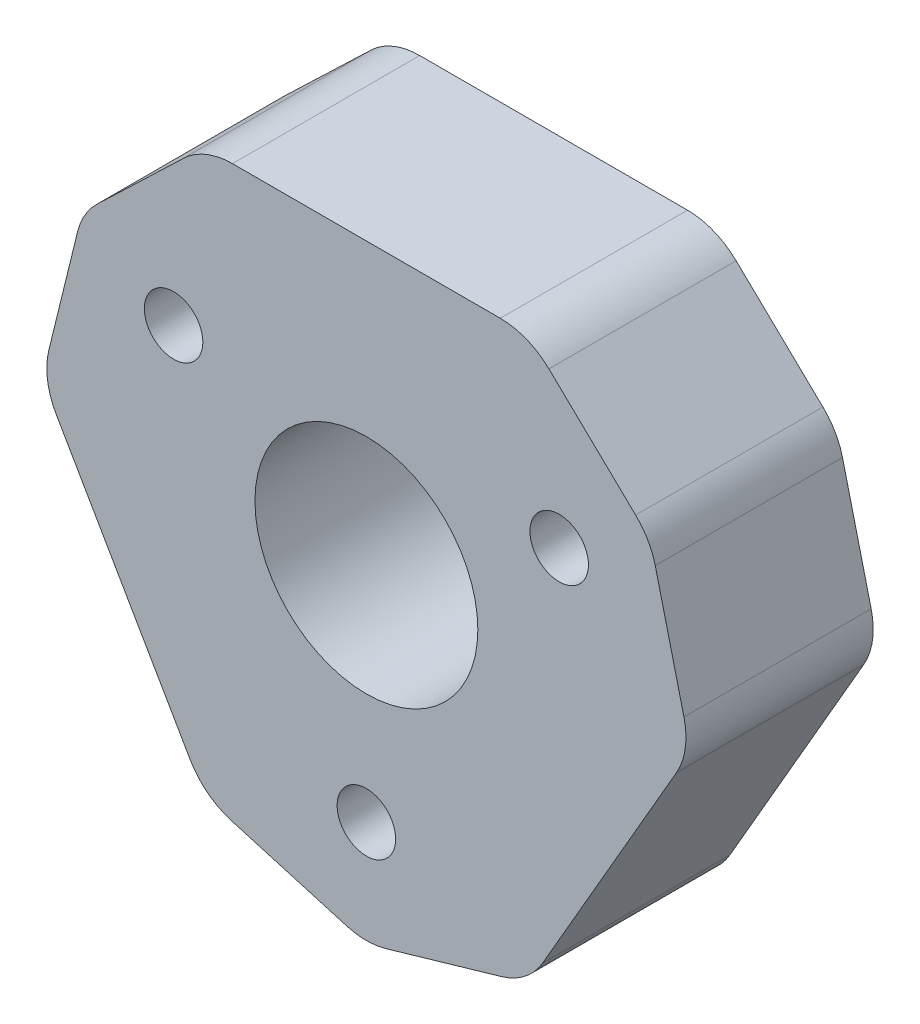
ISO-10303-21;
HEADER;
FILE_DESCRIPTION(('STEP AP214'),'2;1');
FILE_NAME('part.step','',(''),(''),'','','');
FILE_SCHEMA(('AUTOMOTIVE_DESIGN { 1 0 10303 214 1 1 1 1 }'));
ENDSEC;
DATA;
#1=APPLICATION_CONTEXT('core data for automotive mechanical design processes');
#2=APPLICATION_PROTOCOL_DEFINITION('international standard','automotive_design',2000,#1);
#3=PRODUCT_CONTEXT('',#1,'mechanical');
#4=PRODUCT('Part','Part','',(#3));
#5=PRODUCT_RELATED_PRODUCT_CATEGORY('part','',(#4));
#6=PRODUCT_DEFINITION_FORMATION('','',#4);
#7=PRODUCT_DEFINITION_CONTEXT('part definition',#1,'design');
#8=PRODUCT_DEFINITION('design','',#6,#7);
#9=PRODUCT_DEFINITION_SHAPE('','',#8);
#10=(LENGTH_UNIT() NAMED_UNIT(*) SI_UNIT(.MILLI.,.METRE.));
#11=(NAMED_UNIT(*) PLANE_ANGLE_UNIT() SI_UNIT($,.RADIAN.));
#12=(NAMED_UNIT(*) SI_UNIT($,.STERADIAN.) SOLID_ANGLE_UNIT());
#13=UNCERTAINTY_MEASURE_WITH_UNIT(LENGTH_MEASURE(1.E-05),#10,'distance_accuracy_value','');
#14=(GEOMETRIC_REPRESENTATION_CONTEXT(3) GLOBAL_UNCERTAINTY_ASSIGNED_CONTEXT((#13)) GLOBAL_UNIT_ASSIGNED_CONTEXT((#10,
#11,#12)) REPRESENTATION_CONTEXT('',''));
#15=CARTESIAN_POINT('',(0.,0.,0.));
#16=DIRECTION('',(0.,0.,1.));
#17=DIRECTION('',(1.,0.,0.));
#18=AXIS2_PLACEMENT_3D('',#15,#16,#17);
#19=CARTESIAN_POINT('',(0.,-10.888495471054,8.));
#20=DIRECTION('',(0.,0.,1.));
#21=DIRECTION('',(1.,0.,0.));
#22=AXIS2_PLACEMENT_3D('',#19,#20,#21);
#23=PLANE('',#22);
#24=CARTESIAN_POINT('',(8.23806665349945,4.75625000000004,8.));
#25=DIRECTION('',(0.,0.,1.));
#26=DIRECTION('',(1.,0.,0.));
#27=AXIS2_PLACEMENT_3D('',#24,#25,#26);
#28=CIRCLE('',#27,1.25);
#29=CARTESIAN_POINT('',(9.48806665349945,4.75625000000004,8.));
#30=VERTEX_POINT('',#29);
#31=EDGE_CURVE('E383',#30,#30,#28,.T.);
#32=ORIENTED_EDGE('',*,*,#31,.F.);
#33=EDGE_LOOP('',(#32));
#34=FACE_BOUND('',#33,.T.);
#35=CARTESIAN_POINT('',(0.,0.,8.));
#36=DIRECTION('',(0.,0.,1.));
#37=DIRECTION('',(1.,0.,0.));
#38=AXIS2_PLACEMENT_3D('',#35,#36,#37);
#39=CIRCLE('',#38,4.7625);
#40=CARTESIAN_POINT('',(4.7625,0.,8.));
#41=VERTEX_POINT('',#40);
#42=EDGE_CURVE('E208',#41,#41,#39,.T.);
#43=ORIENTED_EDGE('',*,*,#42,.F.);
#44=EDGE_LOOP('',(#43));
#45=FACE_BOUND('',#44,.T.);
#46=CARTESIAN_POINT('',(0.,-10.888495471054,8.));
#47=DIRECTION('',(0.,0.,1.));
#48=DIRECTION('',(1.,0.,0.));
#49=AXIS2_PLACEMENT_3D('',#46,#47,#48);
#50=CIRCLE('',#49,3.);
#51=CARTESIAN_POINT('',(-0.836847118322304,-13.7694131895173,8.));
#52=VERTEX_POINT('',#51);
#53=CARTESIAN_POINT('',(0.836847118322307,-13.7694131895173,8.));
#54=VERTEX_POINT('',#53);
#55=EDGE_CURVE('E239',#52,#54,#50,.T.);
#56=ORIENTED_EDGE('',*,*,#55,.T.);
#57=DIRECTION('',(0.960305906154426,0.278949039440768,0.));
#58=VECTOR('',#57,1.);
#59=CARTESIAN_POINT('',(0.836847118322307,-13.7694131895173,8.));
#60=LINE('',#59,#58);
#61=CARTESIAN_POINT('',(5.77000843492431,-12.3364316761752,8.));
#62=VERTEX_POINT('',#61);
#63=EDGE_CURVE('E137',#54,#62,#60,.T.);
#64=ORIENTED_EDGE('',*,*,#63,.T.);
#65=CARTESIAN_POINT('',(4.933161316602,-9.45551395771196,8.));
#66=DIRECTION('',(0.,0.,1.));
#67=DIRECTION('',(1.,0.,0.));
#68=AXIS2_PLACEMENT_3D('',#65,#66,#67);
#69=CIRCLE('',#68,3.);
#70=CARTESIAN_POINT('',(7.53123752795532,-10.955513957712,8.));
#71=VERTEX_POINT('',#70);
#72=EDGE_CURVE('E284',#62,#71,#69,.T.);
#73=ORIENTED_EDGE('',*,*,#72,.T.);
#74=DIRECTION('',(0.5,0.866025403784439,0.));
#75=VECTOR('',#74,1.);
#76=CARTESIAN_POINT('',(7.53123752795532,-10.955513957712,8.));
#77=LINE('',#76,#75);
#78=CARTESIAN_POINT('',(13.2533721628712,-1.04448604228803,8.));
#79=VERTEX_POINT('',#78);
#80=EDGE_CURVE('E303',#71,#79,#77,.T.);
#81=ORIENTED_EDGE('',*,*,#80,.T.);
#82=CARTESIAN_POINT('',(10.6552959515179,0.455513957711965,8.));
#83=DIRECTION('',(0.,0.,1.));
#84=DIRECTION('',(1.,0.,0.));
#85=AXIS2_PLACEMENT_3D('',#82,#83,#84);
#86=CIRCLE('',#85,3.);
#87=CARTESIAN_POINT('',(13.568667441081,1.17124195339269,8.));
#88=VERTEX_POINT('',#87);
#89=EDGE_CURVE('E300',#79,#88,#86,.T.);
#90=ORIENTED_EDGE('',*,*,#89,.T.);
#91=DIRECTION('',(-0.238575998560241,0.971123829854352,0.));
#92=VECTOR('',#91,1.);
#93=CARTESIAN_POINT('',(12.3430851764876,6.15997573120773,8.));
#94=LINE('',#93,#92);
#95=CARTESIAN_POINT('',(12.3430851764876,6.15997573120773,8.));
#96=VERTEX_POINT('',#95);
#97=EDGE_CURVE('E302',#88,#96,#94,.T.);
#98=ORIENTED_EDGE('',*,*,#97,.T.);
#99=CARTESIAN_POINT('',(9.42971368692458,5.44424773552701,8.));
#100=DIRECTION('',(0.,0.,1.));
#101=DIRECTION('',(-1.,0.,0.));
#102=AXIS2_PLACEMENT_3D('',#99,#100,#101);
#103=CIRCLE('',#102,3.);
#104=CARTESIAN_POINT('',(11.5062380581653,7.60943745830957,8.));
#105=VERTEX_POINT('',#104);
#106=EDGE_CURVE('E305',#96,#105,#103,.T.);
#107=ORIENTED_EDGE('',*,*,#106,.T.);
#108=DIRECTION('',(-0.721729907594186,0.692174790413584,0.));
#109=VECTOR('',#108,1.);
#110=CARTESIAN_POINT('',(7.79865900615664,11.1651897227826,8.));
#111=LINE('',#110,#109);
#112=CARTESIAN_POINT('',(7.79865900615664,11.1651897227826,8.));
#113=VERTEX_POINT('',#112);
#114=EDGE_CURVE('E311',#105,#113,#111,.T.);
#115=ORIENTED_EDGE('',*,*,#114,.T.);
#116=CARTESIAN_POINT('',(5.72213463491589,9.,8.));
#117=DIRECTION('',(0.,0.,1.));
#118=DIRECTION('',(1.,0.,0.));
#119=AXIS2_PLACEMENT_3D('',#116,#117,#118);
#120=CIRCLE('',#119,3.);
#121=CARTESIAN_POINT('',(5.72213463491589,12.,8.));
#122=VERTEX_POINT('',#121);
#123=EDGE_CURVE('E313',#113,#122,#120,.T.);
#124=ORIENTED_EDGE('',*,*,#123,.T.);
#125=DIRECTION('',(-1.,0.,0.));
#126=VECTOR('',#125,1.);
#127=CARTESIAN_POINT('',(5.72213463491589,12.,8.));
#128=LINE('',#127,#126);
#129=CARTESIAN_POINT('',(-5.72213463491589,12.,8.));
#130=VERTEX_POINT('',#129);
#131=EDGE_CURVE('E315',#122,#130,#128,.T.);
#132=ORIENTED_EDGE('',*,*,#131,.T.);
#133=CARTESIAN_POINT('',(-5.72213463491589,9.,8.));
#134=DIRECTION('',(0.,0.,1.));
#135=DIRECTION('',(1.,0.,0.));
#136=AXIS2_PLACEMENT_3D('',#133,#134,#135);
#137=CIRCLE('',#136,3.);
#138=CARTESIAN_POINT('',(-7.79865900615665,11.1651897227826,8.));
#139=VERTEX_POINT('',#138);
#140=EDGE_CURVE('E317',#130,#139,#137,.T.);
#141=ORIENTED_EDGE('',*,*,#140,.T.);
#142=DIRECTION('',(-0.721729907594183,-0.692174790413587,0.));
#143=VECTOR('',#142,1.);
#144=CARTESIAN_POINT('',(-7.79865900615665,11.1651897227826,8.));
#145=LINE('',#144,#143);
#146=CARTESIAN_POINT('',(-11.5062380581653,7.60943745830954,8.));
#147=VERTEX_POINT('',#146);
#148=EDGE_CURVE('E319',#139,#147,#145,.T.);
#149=ORIENTED_EDGE('',*,*,#148,.T.);
#150=CARTESIAN_POINT('',(-9.42971368692457,5.44424773552699,8.));
#151=DIRECTION('',(0.,0.,1.));
#152=DIRECTION('',(1.,0.,0.));
#153=AXIS2_PLACEMENT_3D('',#150,#151,#152);
#154=CIRCLE('',#153,3.);
#155=CARTESIAN_POINT('',(-12.3430851764876,6.15997573120772,8.));
#156=VERTEX_POINT('',#155);
#157=EDGE_CURVE('E321',#147,#156,#154,.T.);
#158=ORIENTED_EDGE('',*,*,#157,.T.);
#159=DIRECTION('',(-0.238575998560243,-0.971123829854351,0.));
#160=VECTOR('',#159,1.);
#161=CARTESIAN_POINT('',(-12.3430851764876,6.15997573120772,8.));
#162=LINE('',#161,#160);
#163=CARTESIAN_POINT('',(-13.5686674410809,1.17124195339268,8.));
#164=VERTEX_POINT('',#163);
#165=EDGE_CURVE('E323',#156,#164,#162,.T.);
#166=ORIENTED_EDGE('',*,*,#165,.T.);
#167=CARTESIAN_POINT('',(-10.6552959515179,0.455513957711953,8.));
#168=DIRECTION('',(0.,0.,1.));
#169=DIRECTION('',(-1.,0.,0.));
#170=AXIS2_PLACEMENT_3D('',#167,#168,#169);
#171=CIRCLE('',#170,3.);
#172=CARTESIAN_POINT('',(-13.2533721628712,-1.04448604228805,8.));
#173=VERTEX_POINT('',#172);
#174=EDGE_CURVE('E186',#164,#173,#171,.T.);
#175=ORIENTED_EDGE('',*,*,#174,.T.);
#176=DIRECTION('',(0.5,-0.866025403784438,0.));
#177=VECTOR('',#176,1.);
#178=CARTESIAN_POINT('',(-13.2533721628712,-1.04448604228805,8.));
#179=LINE('',#178,#177);
#180=CARTESIAN_POINT('',(-7.53123752795531,-10.955513957712,8.));
#181=VERTEX_POINT('',#180);
#182=EDGE_CURVE('E180',#173,#181,#179,.T.);
#183=ORIENTED_EDGE('',*,*,#182,.T.);
#184=CARTESIAN_POINT('',(-4.933161316602,-9.45551395771196,8.));
#185=DIRECTION('',(0.,0.,1.));
#186=DIRECTION('',(1.,0.,0.));
#187=AXIS2_PLACEMENT_3D('',#184,#185,#186);
#188=CIRCLE('',#187,3.);
#189=CARTESIAN_POINT('',(-5.7700084349243,-12.3364316761752,8.));
#190=VERTEX_POINT('',#189);
#191=EDGE_CURVE('E184',#181,#190,#188,.T.);
#192=ORIENTED_EDGE('',*,*,#191,.T.);
#193=DIRECTION('',(0.960305906154425,-0.278949039440769,0.));
#194=VECTOR('',#193,1.);
#195=CARTESIAN_POINT('',(-5.7700084349243,-12.3364316761752,8.));
#196=LINE('',#195,#194);
#197=EDGE_CURVE('E64',#190,#52,#196,.T.);
#198=ORIENTED_EDGE('',*,*,#197,.T.);
#199=EDGE_LOOP('',(#56,#64,#73,#81,#90,#98,#107,#115,#124,#132,#141,#149,#158,#166,#175,#183,
#192,#198));
#200=FACE_BOUND('',#199,.T.);
#201=CARTESIAN_POINT('',(-8.23806665349949,4.75624999999998,8.));
#202=DIRECTION('',(0.,0.,1.));
#203=DIRECTION('',(1.,0.,0.));
#204=AXIS2_PLACEMENT_3D('',#201,#202,#203);
#205=CIRCLE('',#204,1.25);
#206=CARTESIAN_POINT('',(-6.98806665349949,4.75624999999998,8.));
#207=VERTEX_POINT('',#206);
#208=EDGE_CURVE('E389',#207,#207,#205,.T.);
#209=ORIENTED_EDGE('',*,*,#208,.F.);
#210=EDGE_LOOP('',(#209));
#211=FACE_BOUND('',#210,.T.);
#212=CARTESIAN_POINT('',(0.,-9.5125,8.));
#213=DIRECTION('',(0.,0.,1.));
#214=DIRECTION('',(1.,0.,0.));
#215=AXIS2_PLACEMENT_3D('',#212,#213,#214);
#216=CIRCLE('',#215,1.25);
#217=CARTESIAN_POINT('',(1.25,-9.5125,8.));
#218=VERTEX_POINT('',#217);
#219=EDGE_CURVE('E374',#218,#218,#216,.T.);
#220=ORIENTED_EDGE('',*,*,#219,.F.);
#221=EDGE_LOOP('',(#220));
#222=FACE_BOUND('',#221,.T.);
#223=ADVANCED_FACE('F47',(#34,#45,#200,#211,#222),#23,.T.);
#224=CARTESIAN_POINT('',(0.,-10.888495471054,0.));
#225=DIRECTION('',(0.,0.,1.));
#226=DIRECTION('',(1.,0.,0.));
#227=AXIS2_PLACEMENT_3D('',#224,#225,#226);
#228=PLANE('',#227);
#229=CARTESIAN_POINT('',(0.,-10.888495471054,0.));
#230=DIRECTION('',(0.,0.,1.));
#231=DIRECTION('',(1.,0.,0.));
#232=AXIS2_PLACEMENT_3D('',#229,#230,#231);
#233=CIRCLE('',#232,3.);
#234=CARTESIAN_POINT('',(-0.836847118322304,-13.7694131895173,0.));
#235=VERTEX_POINT('',#234);
#236=CARTESIAN_POINT('',(0.836847118322307,-13.7694131895173,0.));
#237=VERTEX_POINT('',#236);
#238=EDGE_CURVE('E204',#235,#237,#233,.T.);
#239=ORIENTED_EDGE('',*,*,#238,.F.);
#240=DIRECTION('',(0.960305906154425,-0.278949039440769,0.));
#241=VECTOR('',#240,1.);
#242=CARTESIAN_POINT('',(-5.7700084349243,-12.3364316761752,0.));
#243=LINE('',#242,#241);
#244=CARTESIAN_POINT('',(-5.7700084349243,-12.3364316761752,0.));
#245=VERTEX_POINT('',#244);
#246=EDGE_CURVE('E129',#245,#235,#243,.T.);
#247=ORIENTED_EDGE('',*,*,#246,.F.);
#248=CARTESIAN_POINT('',(-4.933161316602,-9.45551395771196,0.));
#249=DIRECTION('',(0.,0.,1.));
#250=DIRECTION('',(1.,0.,0.));
#251=AXIS2_PLACEMENT_3D('',#248,#249,#250);
#252=CIRCLE('',#251,3.);
#253=CARTESIAN_POINT('',(-7.53123752795531,-10.955513957712,0.));
#254=VERTEX_POINT('',#253);
#255=EDGE_CURVE('E123',#254,#245,#252,.T.);
#256=ORIENTED_EDGE('',*,*,#255,.F.);
#257=DIRECTION('',(0.5,-0.866025403784438,0.));
#258=VECTOR('',#257,1.);
#259=CARTESIAN_POINT('',(-13.2533721628712,-1.04448604228805,0.));
#260=LINE('',#259,#258);
#261=CARTESIAN_POINT('',(-13.2533721628712,-1.04448604228805,0.));
#262=VERTEX_POINT('',#261);
#263=EDGE_CURVE('E194',#262,#254,#260,.T.);
#264=ORIENTED_EDGE('',*,*,#263,.F.);
#265=CARTESIAN_POINT('',(-10.6552959515179,0.455513957711953,0.));
#266=DIRECTION('',(0.,0.,1.));
#267=DIRECTION('',(-1.,0.,0.));
#268=AXIS2_PLACEMENT_3D('',#265,#266,#267);
#269=CIRCLE('',#268,3.);
#270=CARTESIAN_POINT('',(-13.5686674410809,1.17124195339268,0.));
#271=VERTEX_POINT('',#270);
#272=EDGE_CURVE('E234',#271,#262,#269,.T.);
#273=ORIENTED_EDGE('',*,*,#272,.F.);
#274=DIRECTION('',(-0.238575998560243,-0.971123829854351,0.));
#275=VECTOR('',#274,1.);
#276=CARTESIAN_POINT('',(-12.3430851764876,6.15997573120772,0.));
#277=LINE('',#276,#275);
#278=CARTESIAN_POINT('',(-12.3430851764876,6.15997573120772,0.));
#279=VERTEX_POINT('',#278);
#280=EDGE_CURVE('E232',#279,#271,#277,.T.);
#281=ORIENTED_EDGE('',*,*,#280,.F.);
#282=CARTESIAN_POINT('',(-9.42971368692457,5.44424773552699,0.));
#283=DIRECTION('',(0.,0.,1.));
#284=DIRECTION('',(1.,0.,0.));
#285=AXIS2_PLACEMENT_3D('',#282,#283,#284);
#286=CIRCLE('',#285,3.);
#287=CARTESIAN_POINT('',(-11.5062380581653,7.60943745830954,0.));
#288=VERTEX_POINT('',#287);
#289=EDGE_CURVE('E230',#288,#279,#286,.T.);
#290=ORIENTED_EDGE('',*,*,#289,.F.);
#291=DIRECTION('',(-0.721729907594183,-0.692174790413587,0.));
#292=VECTOR('',#291,1.);
#293=CARTESIAN_POINT('',(-7.79865900615665,11.1651897227826,0.));
#294=LINE('',#293,#292);
#295=CARTESIAN_POINT('',(-7.79865900615665,11.1651897227826,0.));
#296=VERTEX_POINT('',#295);
#297=EDGE_CURVE('E228',#296,#288,#294,.T.);
#298=ORIENTED_EDGE('',*,*,#297,.F.);
#299=CARTESIAN_POINT('',(-5.72213463491589,9.,0.));
#300=DIRECTION('',(0.,0.,1.));
#301=DIRECTION('',(1.,0.,0.));
#302=AXIS2_PLACEMENT_3D('',#299,#300,#301);
#303=CIRCLE('',#302,3.);
#304=CARTESIAN_POINT('',(-5.72213463491589,12.,0.));
#305=VERTEX_POINT('',#304);
#306=EDGE_CURVE('E226',#305,#296,#303,.T.);
#307=ORIENTED_EDGE('',*,*,#306,.F.);
#308=DIRECTION('',(-1.,0.,0.));
#309=VECTOR('',#308,1.);
#310=CARTESIAN_POINT('',(5.72213463491589,12.,0.));
#311=LINE('',#310,#309);
#312=CARTESIAN_POINT('',(5.72213463491589,12.,0.));
#313=VERTEX_POINT('',#312);
#314=EDGE_CURVE('E224',#313,#305,#311,.T.);
#315=ORIENTED_EDGE('',*,*,#314,.F.);
#316=CARTESIAN_POINT('',(5.72213463491589,9.,0.));
#317=DIRECTION('',(0.,0.,1.));
#318=DIRECTION('',(1.,0.,0.));
#319=AXIS2_PLACEMENT_3D('',#316,#317,#318);
#320=CIRCLE('',#319,3.);
#321=CARTESIAN_POINT('',(7.79865900615664,11.1651897227826,0.));
#322=VERTEX_POINT('',#321);
#323=EDGE_CURVE('E222',#322,#313,#320,.T.);
#324=ORIENTED_EDGE('',*,*,#323,.F.);
#325=DIRECTION('',(-0.721729907594186,0.692174790413584,0.));
#326=VECTOR('',#325,1.);
#327=CARTESIAN_POINT('',(7.79865900615664,11.1651897227826,0.));
#328=LINE('',#327,#326);
#329=CARTESIAN_POINT('',(11.5062380581653,7.60943745830957,0.));
#330=VERTEX_POINT('',#329);
#331=EDGE_CURVE('E220',#330,#322,#328,.T.);
#332=ORIENTED_EDGE('',*,*,#331,.F.);
#333=CARTESIAN_POINT('',(9.42971368692458,5.44424773552701,0.));
#334=DIRECTION('',(0.,0.,1.));
#335=DIRECTION('',(-1.,0.,0.));
#336=AXIS2_PLACEMENT_3D('',#333,#334,#335);
#337=CIRCLE('',#336,3.);
#338=CARTESIAN_POINT('',(12.3430851764876,6.15997573120773,0.));
#339=VERTEX_POINT('',#338);
#340=EDGE_CURVE('E218',#339,#330,#337,.T.);
#341=ORIENTED_EDGE('',*,*,#340,.F.);
#342=DIRECTION('',(-0.238575998560241,0.971123829854352,0.));
#343=VECTOR('',#342,1.);
#344=CARTESIAN_POINT('',(12.3430851764876,6.15997573120773,0.));
#345=LINE('',#344,#343);
#346=CARTESIAN_POINT('',(13.568667441081,1.17124195339269,0.));
#347=VERTEX_POINT('',#346);
#348=EDGE_CURVE('E216',#347,#339,#345,.T.);
#349=ORIENTED_EDGE('',*,*,#348,.F.);
#350=CARTESIAN_POINT('',(10.6552959515179,0.455513957711965,0.));
#351=DIRECTION('',(0.,0.,1.));
#352=DIRECTION('',(1.,0.,0.));
#353=AXIS2_PLACEMENT_3D('',#350,#351,#352);
#354=CIRCLE('',#353,3.);
#355=CARTESIAN_POINT('',(13.2533721628712,-1.04448604228803,0.));
#356=VERTEX_POINT('',#355);
#357=EDGE_CURVE('E214',#356,#347,#354,.T.);
#358=ORIENTED_EDGE('',*,*,#357,.F.);
#359=DIRECTION('',(0.5,0.866025403784439,0.));
#360=VECTOR('',#359,1.);
#361=CARTESIAN_POINT('',(7.53123752795532,-10.955513957712,0.));
#362=LINE('',#361,#360);
#363=CARTESIAN_POINT('',(7.53123752795532,-10.955513957712,0.));
#364=VERTEX_POINT('',#363);
#365=EDGE_CURVE('E212',#364,#356,#362,.T.);
#366=ORIENTED_EDGE('',*,*,#365,.F.);
#367=CARTESIAN_POINT('',(4.933161316602,-9.45551395771196,0.));
#368=DIRECTION('',(0.,0.,1.));
#369=DIRECTION('',(1.,0.,0.));
#370=AXIS2_PLACEMENT_3D('',#367,#368,#369);
#371=CIRCLE('',#370,3.);
#372=CARTESIAN_POINT('',(5.77000843492431,-12.3364316761752,0.));
#373=VERTEX_POINT('',#372);
#374=EDGE_CURVE('E210',#373,#364,#371,.T.);
#375=ORIENTED_EDGE('',*,*,#374,.F.);
#376=DIRECTION('',(0.960305906154426,0.278949039440768,0.));
#377=VECTOR('',#376,1.);
#378=CARTESIAN_POINT('',(0.836847118322307,-13.7694131895173,0.));
#379=LINE('',#378,#377);
#380=EDGE_CURVE('E207',#237,#373,#379,.T.);
#381=ORIENTED_EDGE('',*,*,#380,.F.);
#382=EDGE_LOOP('',(#239,#247,#256,#264,#273,#281,#290,#298,#307,#315,#324,#332,#341,#349,#358,
#366,#375,#381));
#383=FACE_BOUND('',#382,.T.);
#384=CARTESIAN_POINT('',(0.,0.,0.));
#385=DIRECTION('',(0.,0.,1.));
#386=DIRECTION('',(1.,0.,0.));
#387=AXIS2_PLACEMENT_3D('',#384,#385,#386);
#388=CIRCLE('',#387,4.7625);
#389=CARTESIAN_POINT('',(4.7625,0.,0.));
#390=VERTEX_POINT('',#389);
#391=EDGE_CURVE('E392',#390,#390,#388,.T.);
#392=ORIENTED_EDGE('',*,*,#391,.T.);
#393=EDGE_LOOP('',(#392));
#394=FACE_BOUND('',#393,.T.);
#395=CARTESIAN_POINT('',(-8.23806665349949,4.75624999999998,0.));
#396=DIRECTION('',(0.,0.,1.));
#397=DIRECTION('',(1.,0.,0.));
#398=AXIS2_PLACEMENT_3D('',#395,#396,#397);
#399=CIRCLE('',#398,1.25);
#400=CARTESIAN_POINT('',(-6.98806665349949,4.75624999999998,0.));
#401=VERTEX_POINT('',#400);
#402=EDGE_CURVE('E386',#401,#401,#399,.T.);
#403=ORIENTED_EDGE('',*,*,#402,.T.);
#404=EDGE_LOOP('',(#403));
#405=FACE_BOUND('',#404,.T.);
#406=CARTESIAN_POINT('',(8.23806665349945,4.75625000000004,0.));
#407=DIRECTION('',(0.,0.,1.));
#408=DIRECTION('',(1.,0.,0.));
#409=AXIS2_PLACEMENT_3D('',#406,#407,#408);
#410=CIRCLE('',#409,1.25);
#411=CARTESIAN_POINT('',(9.48806665349945,4.75625000000004,0.));
#412=VERTEX_POINT('',#411);
#413=EDGE_CURVE('E380',#412,#412,#410,.T.);
#414=ORIENTED_EDGE('',*,*,#413,.T.);
#415=EDGE_LOOP('',(#414));
#416=FACE_BOUND('',#415,.T.);
#417=CARTESIAN_POINT('',(0.,-9.5125,0.));
#418=DIRECTION('',(0.,0.,1.));
#419=DIRECTION('',(1.,0.,0.));
#420=AXIS2_PLACEMENT_3D('',#417,#418,#419);
#421=CIRCLE('',#420,1.25);
#422=CARTESIAN_POINT('',(1.25,-9.5125,0.));
#423=VERTEX_POINT('',#422);
#424=EDGE_CURVE('E377',#423,#423,#421,.T.);
#425=ORIENTED_EDGE('',*,*,#424,.T.);
#426=EDGE_LOOP('',(#425));
#427=FACE_BOUND('',#426,.T.);
#428=ADVANCED_FACE('F288',(#383,#394,#405,#416,#427),#228,.F.);
#429=CARTESIAN_POINT('',(0.,-10.888495471054,8.));
#430=DIRECTION('',(0.,0.,-1.));
#431=DIRECTION('',(-1.,0.,0.));
#432=AXIS2_PLACEMENT_3D('',#429,#430,#431);
#433=CYLINDRICAL_SURFACE('',#432,3.);
#434=ORIENTED_EDGE('',*,*,#238,.T.);
#435=DIRECTION('',(0.,0.,-1.));
#436=VECTOR('',#435,1.);
#437=CARTESIAN_POINT('',(0.836847118322307,-13.7694131895173,8.));
#438=LINE('',#437,#436);
#439=EDGE_CURVE('E11',#54,#237,#438,.T.);
#440=ORIENTED_EDGE('',*,*,#439,.F.);
#441=ORIENTED_EDGE('',*,*,#55,.F.);
#442=DIRECTION('',(0.,0.,-1.));
#443=VECTOR('',#442,1.);
#444=CARTESIAN_POINT('',(-0.836847118322304,-13.7694131895173,8.));
#445=LINE('',#444,#443);
#446=EDGE_CURVE('E200',#52,#235,#445,.T.);
#447=ORIENTED_EDGE('',*,*,#446,.T.);
#448=EDGE_LOOP('',(#434,#440,#441,#447));
#449=FACE_BOUND('',#448,.T.);
#450=ADVANCED_FACE('F49',(#449),#433,.T.);
#451=CARTESIAN_POINT('',(0.836847118322307,-13.7694131895173,8.));
#452=DIRECTION('',(-0.278949039440768,0.960305906154426,0.));
#453=DIRECTION('',(-0.960305906154426,-0.278949039440768,0.));
#454=AXIS2_PLACEMENT_3D('',#451,#452,#453);
#455=PLANE('',#454);
#456=ORIENTED_EDGE('',*,*,#380,.T.);
#457=DIRECTION('',(0.,0.,-1.));
#458=VECTOR('',#457,1.);
#459=CARTESIAN_POINT('',(5.77000843492431,-12.3364316761752,8.));
#460=LINE('',#459,#458);
#461=EDGE_CURVE('E56',#62,#373,#460,.T.);
#462=ORIENTED_EDGE('',*,*,#461,.F.);
#463=ORIENTED_EDGE('',*,*,#63,.F.);
#464=ORIENTED_EDGE('',*,*,#439,.T.);
#465=EDGE_LOOP('',(#456,#462,#463,#464));
#466=FACE_BOUND('',#465,.T.);
#467=ADVANCED_FACE('F566',(#466),#455,.F.);
#468=CARTESIAN_POINT('',(4.933161316602,-9.45551395771196,8.));
#469=DIRECTION('',(0.,0.,-1.));
#470=DIRECTION('',(-1.,0.,0.));
#471=AXIS2_PLACEMENT_3D('',#468,#469,#470);
#472=CYLINDRICAL_SURFACE('',#471,3.);
#473=ORIENTED_EDGE('',*,*,#374,.T.);
#474=DIRECTION('',(0.,0.,-1.));
#475=VECTOR('',#474,1.);
#476=CARTESIAN_POINT('',(7.53123752795532,-10.955513957712,8.));
#477=LINE('',#476,#475);
#478=EDGE_CURVE('E276',#71,#364,#477,.T.);
#479=ORIENTED_EDGE('',*,*,#478,.F.);
#480=ORIENTED_EDGE('',*,*,#72,.F.);
#481=ORIENTED_EDGE('',*,*,#461,.T.);
#482=EDGE_LOOP('',(#473,#479,#480,#481));
#483=FACE_BOUND('',#482,.T.);
#484=ADVANCED_FACE('F282',(#483),#472,.T.);
#485=CARTESIAN_POINT('',(7.53123752795532,-10.955513957712,8.));
#486=DIRECTION('',(-0.866025403784439,0.5,0.));
#487=DIRECTION('',(-0.5,-0.866025403784439,0.));
#488=AXIS2_PLACEMENT_3D('',#485,#486,#487);
#489=PLANE('',#488);
#490=ORIENTED_EDGE('',*,*,#365,.T.);
#491=DIRECTION('',(0.,0.,-1.));
#492=VECTOR('',#491,1.);
#493=CARTESIAN_POINT('',(13.2533721628712,-1.04448604228803,8.));
#494=LINE('',#493,#492);
#495=EDGE_CURVE('E273',#79,#356,#494,.T.);
#496=ORIENTED_EDGE('',*,*,#495,.F.);
#497=ORIENTED_EDGE('',*,*,#80,.F.);
#498=ORIENTED_EDGE('',*,*,#478,.T.);
#499=EDGE_LOOP('',(#490,#496,#497,#498));
#500=FACE_BOUND('',#499,.T.);
#501=ADVANCED_FACE('F294',(#500),#489,.F.);
#502=CARTESIAN_POINT('',(10.6552959515179,0.455513957711965,8.));
#503=DIRECTION('',(0.,0.,-1.));
#504=DIRECTION('',(-1.,0.,0.));
#505=AXIS2_PLACEMENT_3D('',#502,#503,#504);
#506=CYLINDRICAL_SURFACE('',#505,3.);
#507=ORIENTED_EDGE('',*,*,#357,.T.);
#508=DIRECTION('',(0.,0.,-1.));
#509=VECTOR('',#508,1.);
#510=CARTESIAN_POINT('',(13.568667441081,1.17124195339269,8.));
#511=LINE('',#510,#509);
#512=EDGE_CURVE('E270',#88,#347,#511,.T.);
#513=ORIENTED_EDGE('',*,*,#512,.F.);
#514=ORIENTED_EDGE('',*,*,#89,.F.);
#515=ORIENTED_EDGE('',*,*,#495,.T.);
#516=EDGE_LOOP('',(#507,#513,#514,#515));
#517=FACE_BOUND('',#516,.T.);
#518=ADVANCED_FACE('F298',(#517),#506,.T.);
#519=CARTESIAN_POINT('',(12.3430851764876,6.15997573120773,8.));
#520=DIRECTION('',(-0.971123829854352,-0.238575998560241,0.));
#521=DIRECTION('',(0.238575998560241,-0.971123829854352,0.));
#522=AXIS2_PLACEMENT_3D('',#519,#520,#521);
#523=PLANE('',#522);
#524=ORIENTED_EDGE('',*,*,#348,.T.);
#525=DIRECTION('',(0.,0.,-1.));
#526=VECTOR('',#525,1.);
#527=CARTESIAN_POINT('',(12.3430851764876,6.15997573120773,8.));
#528=LINE('',#527,#526);
#529=EDGE_CURVE('E267',#96,#339,#528,.T.);
#530=ORIENTED_EDGE('',*,*,#529,.F.);
#531=ORIENTED_EDGE('',*,*,#97,.F.);
#532=ORIENTED_EDGE('',*,*,#512,.T.);
#533=EDGE_LOOP('',(#524,#530,#531,#532));
#534=FACE_BOUND('',#533,.T.);
#535=ADVANCED_FACE('F531',(#534),#523,.F.);
#536=CARTESIAN_POINT('',(9.42971368692458,5.44424773552701,8.));
#537=DIRECTION('',(0.,0.,-1.));
#538=DIRECTION('',(-1.,0.,0.));
#539=AXIS2_PLACEMENT_3D('',#536,#537,#538);
#540=CYLINDRICAL_SURFACE('',#539,3.);
#541=ORIENTED_EDGE('',*,*,#340,.T.);
#542=DIRECTION('',(0.,0.,-1.));
#543=VECTOR('',#542,1.);
#544=CARTESIAN_POINT('',(11.5062380581653,7.60943745830957,8.));
#545=LINE('',#544,#543);
#546=EDGE_CURVE('E264',#105,#330,#545,.T.);
#547=ORIENTED_EDGE('',*,*,#546,.F.);
#548=ORIENTED_EDGE('',*,*,#106,.F.);
#549=ORIENTED_EDGE('',*,*,#529,.T.);
#550=EDGE_LOOP('',(#541,#547,#548,#549));
#551=FACE_BOUND('',#550,.T.);
#552=ADVANCED_FACE('F521',(#551),#540,.T.);
#553=CARTESIAN_POINT('',(7.79865900615664,11.1651897227826,8.));
#554=DIRECTION('',(-0.692174790413584,-0.721729907594186,0.));
#555=DIRECTION('',(0.721729907594186,-0.692174790413584,0.));
#556=AXIS2_PLACEMENT_3D('',#553,#554,#555);
#557=PLANE('',#556);
#558=ORIENTED_EDGE('',*,*,#331,.T.);
#559=DIRECTION('',(0.,0.,-1.));
#560=VECTOR('',#559,1.);
#561=CARTESIAN_POINT('',(7.79865900615664,11.1651897227826,8.));
#562=LINE('',#561,#560);
#563=EDGE_CURVE('E261',#113,#322,#562,.T.);
#564=ORIENTED_EDGE('',*,*,#563,.F.);
#565=ORIENTED_EDGE('',*,*,#114,.F.);
#566=ORIENTED_EDGE('',*,*,#546,.T.);
#567=EDGE_LOOP('',(#558,#564,#565,#566));
#568=FACE_BOUND('',#567,.T.);
#569=ADVANCED_FACE('F511',(#568),#557,.F.);
#570=CARTESIAN_POINT('',(5.72213463491589,9.,8.));
#571=DIRECTION('',(0.,0.,-1.));
#572=DIRECTION('',(-1.,0.,0.));
#573=AXIS2_PLACEMENT_3D('',#570,#571,#572);
#574=CYLINDRICAL_SURFACE('',#573,3.);
#575=ORIENTED_EDGE('',*,*,#323,.T.);
#576=DIRECTION('',(0.,0.,-1.));
#577=VECTOR('',#576,1.);
#578=CARTESIAN_POINT('',(5.72213463491589,12.,8.));
#579=LINE('',#578,#577);
#580=EDGE_CURVE('E258',#122,#313,#579,.T.);
#581=ORIENTED_EDGE('',*,*,#580,.F.);
#582=ORIENTED_EDGE('',*,*,#123,.F.);
#583=ORIENTED_EDGE('',*,*,#563,.T.);
#584=EDGE_LOOP('',(#575,#581,#582,#583));
#585=FACE_BOUND('',#584,.T.);
#586=ADVANCED_FACE('F501',(#585),#574,.T.);
#587=CARTESIAN_POINT('',(5.72213463491589,12.,8.));
#588=DIRECTION('',(0.,-1.,0.));
#589=DIRECTION('',(1.,0.,0.));
#590=AXIS2_PLACEMENT_3D('',#587,#588,#589);
#591=PLANE('',#590);
#592=ORIENTED_EDGE('',*,*,#314,.T.);
#593=DIRECTION('',(0.,0.,-1.));
#594=VECTOR('',#593,1.);
#595=CARTESIAN_POINT('',(-5.72213463491589,12.,8.));
#596=LINE('',#595,#594);
#597=EDGE_CURVE('E255',#130,#305,#596,.T.);
#598=ORIENTED_EDGE('',*,*,#597,.F.);
#599=ORIENTED_EDGE('',*,*,#131,.F.);
#600=ORIENTED_EDGE('',*,*,#580,.T.);
#601=EDGE_LOOP('',(#592,#598,#599,#600));
#602=FACE_BOUND('',#601,.T.);
#603=ADVANCED_FACE('F491',(#602),#591,.F.);
#604=CARTESIAN_POINT('',(-5.72213463491589,9.,8.));
#605=DIRECTION('',(0.,0.,-1.));
#606=DIRECTION('',(-1.,0.,0.));
#607=AXIS2_PLACEMENT_3D('',#604,#605,#606);
#608=CYLINDRICAL_SURFACE('',#607,3.);
#609=ORIENTED_EDGE('',*,*,#306,.T.);
#610=DIRECTION('',(0.,0.,-1.));
#611=VECTOR('',#610,1.);
#612=CARTESIAN_POINT('',(-7.79865900615665,11.1651897227826,8.));
#613=LINE('',#612,#611);
#614=EDGE_CURVE('E252',#139,#296,#613,.T.);
#615=ORIENTED_EDGE('',*,*,#614,.F.);
#616=ORIENTED_EDGE('',*,*,#140,.F.);
#617=ORIENTED_EDGE('',*,*,#597,.T.);
#618=EDGE_LOOP('',(#609,#615,#616,#617));
#619=FACE_BOUND('',#618,.T.);
#620=ADVANCED_FACE('F481',(#619),#608,.T.);
#621=CARTESIAN_POINT('',(-7.79865900615665,11.1651897227826,8.));
#622=DIRECTION('',(0.692174790413587,-0.721729907594183,0.));
#623=DIRECTION('',(0.721729907594183,0.692174790413587,0.));
#624=AXIS2_PLACEMENT_3D('',#621,#622,#623);
#625=PLANE('',#624);
#626=ORIENTED_EDGE('',*,*,#297,.T.);
#627=DIRECTION('',(0.,0.,-1.));
#628=VECTOR('',#627,1.);
#629=CARTESIAN_POINT('',(-11.5062380581653,7.60943745830954,8.));
#630=LINE('',#629,#628);
#631=EDGE_CURVE('E249',#147,#288,#630,.T.);
#632=ORIENTED_EDGE('',*,*,#631,.F.);
#633=ORIENTED_EDGE('',*,*,#148,.F.);
#634=ORIENTED_EDGE('',*,*,#614,.T.);
#635=EDGE_LOOP('',(#626,#632,#633,#634));
#636=FACE_BOUND('',#635,.T.);
#637=ADVANCED_FACE('F471',(#636),#625,.F.);
#638=CARTESIAN_POINT('',(-9.42971368692457,5.44424773552699,8.));
#639=DIRECTION('',(0.,0.,-1.));
#640=DIRECTION('',(-1.,0.,0.));
#641=AXIS2_PLACEMENT_3D('',#638,#639,#640);
#642=CYLINDRICAL_SURFACE('',#641,3.);
#643=ORIENTED_EDGE('',*,*,#289,.T.);
#644=DIRECTION('',(0.,0.,-1.));
#645=VECTOR('',#644,1.);
#646=CARTESIAN_POINT('',(-12.3430851764876,6.15997573120772,8.));
#647=LINE('',#646,#645);
#648=EDGE_CURVE('E246',#156,#279,#647,.T.);
#649=ORIENTED_EDGE('',*,*,#648,.F.);
#650=ORIENTED_EDGE('',*,*,#157,.F.);
#651=ORIENTED_EDGE('',*,*,#631,.T.);
#652=EDGE_LOOP('',(#643,#649,#650,#651));
#653=FACE_BOUND('',#652,.T.);
#654=ADVANCED_FACE('F462',(#653),#642,.T.);
#655=CARTESIAN_POINT('',(-12.3430851764876,6.15997573120772,8.));
#656=DIRECTION('',(0.971123829854351,-0.238575998560243,0.));
#657=DIRECTION('',(0.238575998560243,0.971123829854351,0.));
#658=AXIS2_PLACEMENT_3D('',#655,#656,#657);
#659=PLANE('',#658);
#660=ORIENTED_EDGE('',*,*,#280,.T.);
#661=DIRECTION('',(0.,0.,-1.));
#662=VECTOR('',#661,1.);
#663=CARTESIAN_POINT('',(-13.5686674410809,1.17124195339268,8.));
#664=LINE('',#663,#662);
#665=EDGE_CURVE('E243',#164,#271,#664,.T.);
#666=ORIENTED_EDGE('',*,*,#665,.F.);
#667=ORIENTED_EDGE('',*,*,#165,.F.);
#668=ORIENTED_EDGE('',*,*,#648,.T.);
#669=EDGE_LOOP('',(#660,#666,#667,#668));
#670=FACE_BOUND('',#669,.T.);
#671=ADVANCED_FACE('F329',(#670),#659,.F.);
#672=CARTESIAN_POINT('',(-10.6552959515179,0.455513957711953,8.));
#673=DIRECTION('',(0.,0.,-1.));
#674=DIRECTION('',(-1.,0.,0.));
#675=AXIS2_PLACEMENT_3D('',#672,#673,#674);
#676=CYLINDRICAL_SURFACE('',#675,3.);
#677=ORIENTED_EDGE('',*,*,#272,.T.);
#678=DIRECTION('',(0.,0.,-1.));
#679=VECTOR('',#678,1.);
#680=CARTESIAN_POINT('',(-13.2533721628712,-1.04448604228805,8.));
#681=LINE('',#680,#679);
#682=EDGE_CURVE('E195',#173,#262,#681,.T.);
#683=ORIENTED_EDGE('',*,*,#682,.F.);
#684=ORIENTED_EDGE('',*,*,#174,.F.);
#685=ORIENTED_EDGE('',*,*,#665,.T.);
#686=EDGE_LOOP('',(#677,#683,#684,#685));
#687=FACE_BOUND('',#686,.T.);
#688=ADVANCED_FACE('F333',(#687),#676,.T.);
#689=CARTESIAN_POINT('',(-13.2533721628712,-1.04448604228805,8.));
#690=DIRECTION('',(0.866025403784439,0.5,0.));
#691=DIRECTION('',(-0.5,0.866025403784438,0.));
#692=AXIS2_PLACEMENT_3D('',#689,#690,#691);
#693=PLANE('',#692);
#694=ORIENTED_EDGE('',*,*,#263,.T.);
#695=DIRECTION('',(0.,0.,-1.));
#696=VECTOR('',#695,1.);
#697=CARTESIAN_POINT('',(-7.53123752795531,-10.955513957712,8.));
#698=LINE('',#697,#696);
#699=EDGE_CURVE('E191',#181,#254,#698,.T.);
#700=ORIENTED_EDGE('',*,*,#699,.F.);
#701=ORIENTED_EDGE('',*,*,#182,.F.);
#702=ORIENTED_EDGE('',*,*,#682,.T.);
#703=EDGE_LOOP('',(#694,#700,#701,#702));
#704=FACE_BOUND('',#703,.T.);
#705=ADVANCED_FACE('F192',(#704),#693,.F.);
#706=CARTESIAN_POINT('',(-4.933161316602,-9.45551395771196,8.));
#707=DIRECTION('',(0.,0.,-1.));
#708=DIRECTION('',(-1.,0.,0.));
#709=AXIS2_PLACEMENT_3D('',#706,#707,#708);
#710=CYLINDRICAL_SURFACE('',#709,3.);
#711=ORIENTED_EDGE('',*,*,#255,.T.);
#712=DIRECTION('',(0.,0.,-1.));
#713=VECTOR('',#712,1.);
#714=CARTESIAN_POINT('',(-5.7700084349243,-12.3364316761752,8.));
#715=LINE('',#714,#713);
#716=EDGE_CURVE('E196',#190,#245,#715,.T.);
#717=ORIENTED_EDGE('',*,*,#716,.F.);
#718=ORIENTED_EDGE('',*,*,#191,.F.);
#719=ORIENTED_EDGE('',*,*,#699,.T.);
#720=EDGE_LOOP('',(#711,#717,#718,#719));
#721=FACE_BOUND('',#720,.T.);
#722=ADVANCED_FACE('F198',(#721),#710,.T.);
#723=CARTESIAN_POINT('',(-5.7700084349243,-12.3364316761752,8.));
#724=DIRECTION('',(0.278949039440769,0.960305906154426,0.));
#725=DIRECTION('',(-0.960305906154426,0.278949039440769,0.));
#726=AXIS2_PLACEMENT_3D('',#723,#724,#725);
#727=PLANE('',#726);
#728=ORIENTED_EDGE('',*,*,#246,.T.);
#729=ORIENTED_EDGE('',*,*,#446,.F.);
#730=ORIENTED_EDGE('',*,*,#197,.F.);
#731=ORIENTED_EDGE('',*,*,#716,.T.);
#732=EDGE_LOOP('',(#728,#729,#730,#731));
#733=FACE_BOUND('',#732,.T.);
#734=ADVANCED_FACE('F337',(#733),#727,.F.);
#735=CARTESIAN_POINT('',(0.,0.,8.));
#736=DIRECTION('',(0.,0.,-1.));
#737=DIRECTION('',(-1.,0.,0.));
#738=AXIS2_PLACEMENT_3D('',#735,#736,#737);
#739=CYLINDRICAL_SURFACE('',#738,4.7625);
#740=ORIENTED_EDGE('',*,*,#42,.T.);
#741=EDGE_LOOP('',(#740));
#742=FACE_BOUND('',#741,.T.);
#743=ORIENTED_EDGE('',*,*,#391,.F.);
#744=EDGE_LOOP('',(#743));
#745=FACE_BOUND('',#744,.T.);
#746=ADVANCED_FACE('F339',(#742,#745),#739,.F.);
#747=CARTESIAN_POINT('',(-8.23806665349949,4.75624999999998,8.));
#748=DIRECTION('',(0.,0.,-1.));
#749=DIRECTION('',(-1.,0.,0.));
#750=AXIS2_PLACEMENT_3D('',#747,#748,#749);
#751=CYLINDRICAL_SURFACE('',#750,1.25);
#752=ORIENTED_EDGE('',*,*,#208,.T.);
#753=EDGE_LOOP('',(#752));
#754=FACE_BOUND('',#753,.T.);
#755=ORIENTED_EDGE('',*,*,#402,.F.);
#756=EDGE_LOOP('',(#755));
#757=FACE_BOUND('',#756,.T.);
#758=ADVANCED_FACE('F345',(#754,#757),#751,.F.);
#759=CARTESIAN_POINT('',(8.23806665349945,4.75625000000004,8.));
#760=DIRECTION('',(0.,0.,-1.));
#761=DIRECTION('',(-1.,0.,0.));
#762=AXIS2_PLACEMENT_3D('',#759,#760,#761);
#763=CYLINDRICAL_SURFACE('',#762,1.25);
#764=ORIENTED_EDGE('',*,*,#31,.T.);
#765=EDGE_LOOP('',(#764));
#766=FACE_BOUND('',#765,.T.);
#767=ORIENTED_EDGE('',*,*,#413,.F.);
#768=EDGE_LOOP('',(#767));
#769=FACE_BOUND('',#768,.T.);
#770=ADVANCED_FACE('F361',(#766,#769),#763,.F.);
#771=CARTESIAN_POINT('',(0.,-9.5125,8.));
#772=DIRECTION('',(0.,0.,-1.));
#773=DIRECTION('',(-1.,0.,0.));
#774=AXIS2_PLACEMENT_3D('',#771,#772,#773);
#775=CYLINDRICAL_SURFACE('',#774,1.25);
#776=ORIENTED_EDGE('',*,*,#219,.T.);
#777=EDGE_LOOP('',(#776));
#778=FACE_BOUND('',#777,.T.);
#779=ORIENTED_EDGE('',*,*,#424,.F.);
#780=EDGE_LOOP('',(#779));
#781=FACE_BOUND('',#780,.T.);
#782=ADVANCED_FACE('F365',(#778,#781),#775,.F.);
#783=CLOSED_SHELL('',(#223,#428,#450,#467,#484,#501,#518,#535,#552,#569,#586,#603,#620,#637,
#654,#671,#688,#705,#722,#734,#746,#758,#770,#782));
#784=MANIFOLD_SOLID_BREP('B2',#783);
#785=ADVANCED_BREP_SHAPE_REPRESENTATION('',(#18,#784),#14);
#786=SHAPE_DEFINITION_REPRESENTATION(#9,#785);
ENDSEC;
END-ISO-10303-21;
